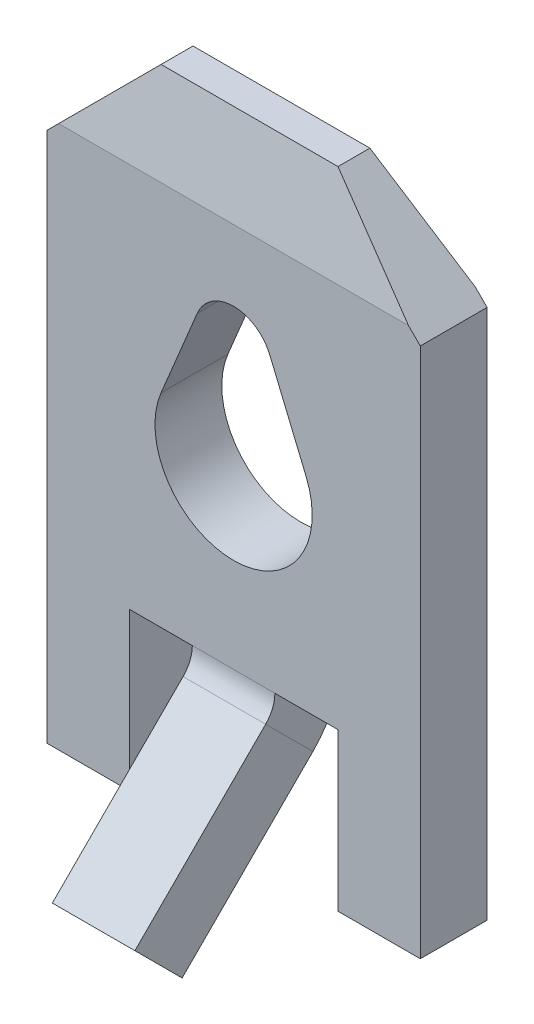
ISO-10303-21;
HEADER;
FILE_DESCRIPTION(('STEP AP214'),'2;1');
FILE_NAME('part.step','',(''),(''),'','','');
FILE_SCHEMA(('AUTOMOTIVE_DESIGN { 1 0 10303 214 1 1 1 1 }'));
ENDSEC;
DATA;
#1=APPLICATION_CONTEXT('core data for automotive mechanical design processes');
#2=APPLICATION_PROTOCOL_DEFINITION('international standard','automotive_design',2000,#1);
#3=PRODUCT_CONTEXT('',#1,'mechanical');
#4=PRODUCT('Part','Part','',(#3));
#5=PRODUCT_RELATED_PRODUCT_CATEGORY('part','',(#4));
#6=PRODUCT_DEFINITION_FORMATION('','',#4);
#7=PRODUCT_DEFINITION_CONTEXT('part definition',#1,'design');
#8=PRODUCT_DEFINITION('design','',#6,#7);
#9=PRODUCT_DEFINITION_SHAPE('','',#8);
#10=(LENGTH_UNIT() NAMED_UNIT(*) SI_UNIT(.MILLI.,.METRE.));
#11=(NAMED_UNIT(*) PLANE_ANGLE_UNIT() SI_UNIT($,.RADIAN.));
#12=(NAMED_UNIT(*) SI_UNIT($,.STERADIAN.) SOLID_ANGLE_UNIT());
#13=UNCERTAINTY_MEASURE_WITH_UNIT(LENGTH_MEASURE(1.E-05),#10,'distance_accuracy_value','');
#14=(GEOMETRIC_REPRESENTATION_CONTEXT(3) GLOBAL_UNCERTAINTY_ASSIGNED_CONTEXT((#13)) GLOBAL_UNIT_ASSIGNED_CONTEXT((#10,
#11,#12)) REPRESENTATION_CONTEXT('',''));
#15=CARTESIAN_POINT('',(0.,0.,0.));
#16=DIRECTION('',(0.,0.,1.));
#17=DIRECTION('',(1.,0.,0.));
#18=AXIS2_PLACEMENT_3D('',#15,#16,#17);
#19=CARTESIAN_POINT('',(4.75,0.149999999999999,0.));
#20=DIRECTION('',(0.,0.,1.));
#21=DIRECTION('',(0.,-1.,0.));
#22=AXIS2_PLACEMENT_3D('',#19,#20,#21);
#23=PLANE('',#22);
#24=DIRECTION('',(0.384813689288076,-0.922994271128754,0.));
#25=VECTOR('',#24,1.);
#26=CARTESIAN_POINT('',(2.84243697464802,5.82748992853653,0.));
#27=LINE('',#26,#25);
#28=CARTESIAN_POINT('',(2.84243697464802,5.82748992853653,0.));
#29=VERTEX_POINT('',#28);
#30=CARTESIAN_POINT('',(3.29799427112875,4.73481368928808,0.));
#31=VERTEX_POINT('',#30);
#32=EDGE_CURVE('E272',#29,#31,#27,.T.);
#33=ORIENTED_EDGE('',*,*,#32,.F.);
#34=CARTESIAN_POINT('',(2.375,5.65,0.));
#35=DIRECTION('',(0.,0.,1.));
#36=DIRECTION('',(0.,-1.,0.));
#37=AXIS2_PLACEMENT_3D('',#34,#35,#36);
#38=CIRCLE('',#37,0.5);
#39=CARTESIAN_POINT('',(1.91346153846154,5.84230769230769,0.));
#40=VERTEX_POINT('',#39);
#41=EDGE_CURVE('E275',#40,#29,#38,.F.);
#42=ORIENTED_EDGE('',*,*,#41,.F.);
#43=DIRECTION('',(0.384615384615385,0.923076923076923,0.));
#44=VECTOR('',#43,1.);
#45=CARTESIAN_POINT('',(1.91346153846154,5.84230769230769,0.));
#46=LINE('',#45,#44);
#47=CARTESIAN_POINT('',(1.45192307692308,4.73461538461538,0.));
#48=VERTEX_POINT('',#47);
#49=EDGE_CURVE('E277',#48,#40,#46,.T.);
#50=ORIENTED_EDGE('',*,*,#49,.F.);
#51=CARTESIAN_POINT('',(2.375,4.35,0.));
#52=DIRECTION('',(0.,0.,1.));
#53=DIRECTION('',(0.,-1.,0.));
#54=AXIS2_PLACEMENT_3D('',#51,#52,#53);
#55=CIRCLE('',#54,1.);
#56=EDGE_CURVE('E269',#31,#48,#55,.F.);
#57=ORIENTED_EDGE('',*,*,#56,.F.);
#58=EDGE_LOOP('',(#33,#42,#50,#57));
#59=FACE_BOUND('',#58,.T.);
#60=DIRECTION('',(1.,0.,0.));
#61=VECTOR('',#60,1.);
#62=CARTESIAN_POINT('',(2.9,2.15,0.));
#63=LINE('',#62,#61);
#64=CARTESIAN_POINT('',(2.9,2.15,0.));
#65=VERTEX_POINT('',#64);
#66=CARTESIAN_POINT('',(3.7,2.15,0.));
#67=VERTEX_POINT('',#66);
#68=EDGE_CURVE('E237',#65,#67,#63,.T.);
#69=ORIENTED_EDGE('',*,*,#68,.F.);
#70=DIRECTION('',(-1.,0.,0.));
#71=VECTOR('',#70,1.);
#72=CARTESIAN_POINT('',(4.75,2.15,0.));
#73=LINE('',#72,#71);
#74=CARTESIAN_POINT('',(1.85000000000001,2.15,0.));
#75=VERTEX_POINT('',#74);
#76=EDGE_CURVE('E50',#65,#75,#73,.T.);
#77=ORIENTED_EDGE('',*,*,#76,.T.);
#78=DIRECTION('',(1.,0.,0.));
#79=VECTOR('',#78,1.);
#80=CARTESIAN_POINT('',(1.85,2.15,0.));
#81=LINE('',#80,#79);
#82=CARTESIAN_POINT('',(1.05,2.15,0.));
#83=VERTEX_POINT('',#82);
#84=EDGE_CURVE('E248',#83,#75,#81,.T.);
#85=ORIENTED_EDGE('',*,*,#84,.F.);
#86=DIRECTION('',(0.,1.,0.));
#87=VECTOR('',#86,1.);
#88=CARTESIAN_POINT('',(1.05,2.15,0.));
#89=LINE('',#88,#87);
#90=CARTESIAN_POINT('',(1.05,0.149999999999999,0.));
#91=VERTEX_POINT('',#90);
#92=EDGE_CURVE('E246',#91,#83,#89,.T.);
#93=ORIENTED_EDGE('',*,*,#92,.F.);
#94=DIRECTION('',(-1.,0.,0.));
#95=VECTOR('',#94,1.);
#96=CARTESIAN_POINT('',(4.75,0.149999999999999,0.));
#97=LINE('',#96,#95);
#98=CARTESIAN_POINT('',(0.,0.149999999999999,0.));
#99=VERTEX_POINT('',#98);
#100=EDGE_CURVE('E346',#91,#99,#97,.T.);
#101=ORIENTED_EDGE('',*,*,#100,.T.);
#102=DIRECTION('',(0.,1.,0.));
#103=VECTOR('',#102,1.);
#104=CARTESIAN_POINT('',(0.,0.149999999999999,0.));
#105=LINE('',#104,#103);
#106=CARTESIAN_POINT('',(0.,6.9,0.));
#107=VERTEX_POINT('',#106);
#108=EDGE_CURVE('E331',#99,#107,#105,.T.);
#109=ORIENTED_EDGE('',*,*,#108,.T.);
#110=DIRECTION('',(-0.707106781186548,-0.707106781186548,0.));
#111=VECTOR('',#110,1.);
#112=CARTESIAN_POINT('',(0.,6.9,0.));
#113=LINE('',#112,#111);
#114=CARTESIAN_POINT('',(0.15,7.05,0.));
#115=VERTEX_POINT('',#114);
#116=EDGE_CURVE('E305',#115,#107,#113,.T.);
#117=ORIENTED_EDGE('',*,*,#116,.F.);
#118=DIRECTION('',(-1.,0.,0.));
#119=VECTOR('',#118,1.);
#120=CARTESIAN_POINT('',(4.75,7.05,0.));
#121=LINE('',#120,#119);
#122=CARTESIAN_POINT('',(4.6,7.05,0.));
#123=VERTEX_POINT('',#122);
#124=EDGE_CURVE('E336',#123,#115,#121,.T.);
#125=ORIENTED_EDGE('',*,*,#124,.F.);
#126=DIRECTION('',(-0.707106781186548,0.707106781186548,0.));
#127=VECTOR('',#126,1.);
#128=CARTESIAN_POINT('',(3.5,8.15,0.));
#129=LINE('',#128,#127);
#130=CARTESIAN_POINT('',(4.75,6.9,0.));
#131=VERTEX_POINT('',#130);
#132=EDGE_CURVE('E301',#131,#123,#129,.T.);
#133=ORIENTED_EDGE('',*,*,#132,.F.);
#134=DIRECTION('',(0.,1.,0.));
#135=VECTOR('',#134,1.);
#136=CARTESIAN_POINT('',(4.75,0.149999999999999,0.));
#137=LINE('',#136,#135);
#138=CARTESIAN_POINT('',(4.75,0.149999999999999,0.));
#139=VERTEX_POINT('',#138);
#140=EDGE_CURVE('E333',#139,#131,#137,.T.);
#141=ORIENTED_EDGE('',*,*,#140,.F.);
#142=CARTESIAN_POINT('',(3.7,0.149999999999999,0.));
#143=VERTEX_POINT('',#142);
#144=EDGE_CURVE('E347',#139,#143,#97,.T.);
#145=ORIENTED_EDGE('',*,*,#144,.T.);
#146=DIRECTION('',(0.,-1.,0.));
#147=VECTOR('',#146,1.);
#148=CARTESIAN_POINT('',(3.7,2.15,0.));
#149=LINE('',#148,#147);
#150=EDGE_CURVE('E261',#67,#143,#149,.T.);
#151=ORIENTED_EDGE('',*,*,#150,.F.);
#152=EDGE_LOOP('',(#69,#77,#85,#93,#101,#109,#117,#125,#133,#141,#145,#151));
#153=FACE_BOUND('',#152,.T.);
#154=ADVANCED_FACE('F43',(#59,#153),#23,.F.);
#155=CARTESIAN_POINT('',(4.75,7.05,0.85));
#156=DIRECTION('',(0.,0.,-1.));
#157=DIRECTION('',(0.,1.,0.));
#158=AXIS2_PLACEMENT_3D('',#155,#156,#157);
#159=PLANE('',#158);
#160=DIRECTION('',(-0.384615384615385,-0.923076923076923,0.));
#161=VECTOR('',#160,1.);
#162=CARTESIAN_POINT('',(1.91346153846154,5.84230769230769,0.849999999999999));
#163=LINE('',#162,#161);
#164=CARTESIAN_POINT('',(1.91346153846154,5.84230769230769,0.85));
#165=VERTEX_POINT('',#164);
#166=CARTESIAN_POINT('',(1.45192307692308,4.73461538461538,0.849999999999999));
#167=VERTEX_POINT('',#166);
#168=EDGE_CURVE('E279',#165,#167,#163,.T.);
#169=ORIENTED_EDGE('',*,*,#168,.F.);
#170=CARTESIAN_POINT('',(2.375,5.65,0.849999999999999));
#171=DIRECTION('',(0.,0.,1.));
#172=DIRECTION('',(1.,0.,0.));
#173=AXIS2_PLACEMENT_3D('',#170,#171,#172);
#174=CIRCLE('',#173,0.5);
#175=CARTESIAN_POINT('',(2.84243697464802,5.82748992853653,0.849999999999999));
#176=VERTEX_POINT('',#175);
#177=EDGE_CURVE('E255',#176,#165,#174,.T.);
#178=ORIENTED_EDGE('',*,*,#177,.F.);
#179=DIRECTION('',(-0.384813689288076,0.922994271128754,0.));
#180=VECTOR('',#179,1.);
#181=CARTESIAN_POINT('',(2.84243697464802,5.82748992853653,0.849999999999999));
#182=LINE('',#181,#180);
#183=CARTESIAN_POINT('',(3.29799427112875,4.73481368928808,0.849999999999999));
#184=VERTEX_POINT('',#183);
#185=EDGE_CURVE('E285',#184,#176,#182,.T.);
#186=ORIENTED_EDGE('',*,*,#185,.F.);
#187=CARTESIAN_POINT('',(2.375,4.35,0.849999999999999));
#188=DIRECTION('',(0.,0.,1.));
#189=DIRECTION('',(1.,0.,0.));
#190=AXIS2_PLACEMENT_3D('',#187,#188,#189);
#191=CIRCLE('',#190,1.);
#192=EDGE_CURVE('E282',#167,#184,#191,.T.);
#193=ORIENTED_EDGE('',*,*,#192,.F.);
#194=EDGE_LOOP('',(#169,#178,#186,#193));
#195=FACE_BOUND('',#194,.T.);
#196=DIRECTION('',(-1.,0.,0.));
#197=VECTOR('',#196,1.);
#198=CARTESIAN_POINT('',(1.85,2.15,0.85));
#199=LINE('',#198,#197);
#200=CARTESIAN_POINT('',(1.85000000000001,2.15,0.849999999999999));
#201=VERTEX_POINT('',#200);
#202=CARTESIAN_POINT('',(1.05,2.15,0.85));
#203=VERTEX_POINT('',#202);
#204=EDGE_CURVE('E242',#201,#203,#199,.T.);
#205=ORIENTED_EDGE('',*,*,#204,.F.);
#206=DIRECTION('',(1.,0.,0.));
#207=VECTOR('',#206,1.);
#208=CARTESIAN_POINT('',(4.75,2.15,0.849999999999999));
#209=LINE('',#208,#207);
#210=CARTESIAN_POINT('',(2.9,2.15,0.849999999999999));
#211=VERTEX_POINT('',#210);
#212=EDGE_CURVE('E363',#201,#211,#209,.T.);
#213=ORIENTED_EDGE('',*,*,#212,.T.);
#214=DIRECTION('',(-1.,0.,0.));
#215=VECTOR('',#214,1.);
#216=CARTESIAN_POINT('',(2.9,2.15,0.85));
#217=LINE('',#216,#215);
#218=CARTESIAN_POINT('',(3.7,2.15,0.85));
#219=VERTEX_POINT('',#218);
#220=EDGE_CURVE('E249',#219,#211,#217,.T.);
#221=ORIENTED_EDGE('',*,*,#220,.F.);
#222=DIRECTION('',(0.,1.,0.));
#223=VECTOR('',#222,1.);
#224=CARTESIAN_POINT('',(3.7,2.15,0.85));
#225=LINE('',#224,#223);
#226=CARTESIAN_POINT('',(3.7,0.149999999999999,0.849999999999999));
#227=VERTEX_POINT('',#226);
#228=EDGE_CURVE('E256',#227,#219,#225,.T.);
#229=ORIENTED_EDGE('',*,*,#228,.F.);
#230=DIRECTION('',(-1.,0.,0.));
#231=VECTOR('',#230,1.);
#232=CARTESIAN_POINT('',(4.75,0.149999999999999,0.849999999999999));
#233=LINE('',#232,#231);
#234=CARTESIAN_POINT('',(4.75,0.149999999999999,0.849999999999999));
#235=VERTEX_POINT('',#234);
#236=EDGE_CURVE('E351',#235,#227,#233,.T.);
#237=ORIENTED_EDGE('',*,*,#236,.F.);
#238=DIRECTION('',(0.,-1.,0.));
#239=VECTOR('',#238,1.);
#240=CARTESIAN_POINT('',(4.75,7.05,0.85));
#241=LINE('',#240,#239);
#242=CARTESIAN_POINT('',(4.75,6.9,0.85));
#243=VERTEX_POINT('',#242);
#244=EDGE_CURVE('E328',#243,#235,#241,.T.);
#245=ORIENTED_EDGE('',*,*,#244,.F.);
#246=DIRECTION('',(0.707106781186548,-0.707106781186548,0.));
#247=VECTOR('',#246,1.);
#248=CARTESIAN_POINT('',(3.5,8.15,0.849999999999999));
#249=LINE('',#248,#247);
#250=CARTESIAN_POINT('',(4.6,7.05,0.849999999999999));
#251=VERTEX_POINT('',#250);
#252=EDGE_CURVE('E297',#251,#243,#249,.T.);
#253=ORIENTED_EDGE('',*,*,#252,.F.);
#254=DIRECTION('',(-1.,0.,0.));
#255=VECTOR('',#254,1.);
#256=CARTESIAN_POINT('',(4.75,7.05,0.85));
#257=LINE('',#256,#255);
#258=CARTESIAN_POINT('',(0.15,7.05,0.849999999999999));
#259=VERTEX_POINT('',#258);
#260=EDGE_CURVE('E354',#251,#259,#257,.T.);
#261=ORIENTED_EDGE('',*,*,#260,.T.);
#262=DIRECTION('',(0.707106781186547,0.707106781186548,0.));
#263=VECTOR('',#262,1.);
#264=CARTESIAN_POINT('',(0.,6.9,0.849999999999999));
#265=LINE('',#264,#263);
#266=CARTESIAN_POINT('',(0.,6.9,0.849999999999999));
#267=VERTEX_POINT('',#266);
#268=EDGE_CURVE('E298',#267,#259,#265,.T.);
#269=ORIENTED_EDGE('',*,*,#268,.F.);
#270=DIRECTION('',(0.,-1.,0.));
#271=VECTOR('',#270,1.);
#272=CARTESIAN_POINT('',(0.,7.05,0.85));
#273=LINE('',#272,#271);
#274=CARTESIAN_POINT('',(0.,0.149999999999999,0.849999999999999));
#275=VERTEX_POINT('',#274);
#276=EDGE_CURVE('E327',#267,#275,#273,.T.);
#277=ORIENTED_EDGE('',*,*,#276,.T.);
#278=CARTESIAN_POINT('',(1.05,0.149999999999999,0.849999999999999));
#279=VERTEX_POINT('',#278);
#280=EDGE_CURVE('E350',#279,#275,#233,.T.);
#281=ORIENTED_EDGE('',*,*,#280,.F.);
#282=DIRECTION('',(0.,-1.,0.));
#283=VECTOR('',#282,1.);
#284=CARTESIAN_POINT('',(1.05,2.15,0.85));
#285=LINE('',#284,#283);
#286=EDGE_CURVE('E244',#203,#279,#285,.T.);
#287=ORIENTED_EDGE('',*,*,#286,.F.);
#288=EDGE_LOOP('',(#205,#213,#221,#229,#237,#245,#253,#261,#269,#277,#281,#287));
#289=FACE_BOUND('',#288,.T.);
#290=ADVANCED_FACE('F383',(#195,#289),#159,.F.);
#291=CARTESIAN_POINT('',(4.75,0.149999999999999,0.));
#292=DIRECTION('',(0.,1.,0.));
#293=DIRECTION('',(0.,0.,1.));
#294=AXIS2_PLACEMENT_3D('',#291,#292,#293);
#295=PLANE('',#294);
#296=ORIENTED_EDGE('',*,*,#100,.F.);
#297=DIRECTION('',(0.,0.,-1.));
#298=VECTOR('',#297,1.);
#299=CARTESIAN_POINT('',(1.05,0.149999999999999,3.0040659228538));
#300=LINE('',#299,#298);
#301=EDGE_CURVE('E64',#279,#91,#300,.T.);
#302=ORIENTED_EDGE('',*,*,#301,.F.);
#303=ORIENTED_EDGE('',*,*,#280,.T.);
#304=DIRECTION('',(0.,0.,-1.));
#305=VECTOR('',#304,1.);
#306=CARTESIAN_POINT('',(0.,0.149999999999999,0.));
#307=LINE('',#306,#305);
#308=EDGE_CURVE('E339',#275,#99,#307,.T.);
#309=ORIENTED_EDGE('',*,*,#308,.T.);
#310=EDGE_LOOP('',(#296,#302,#303,#309));
#311=FACE_BOUND('',#310,.T.);
#312=ADVANCED_FACE('F418',(#311),#295,.F.);
#313=CARTESIAN_POINT('',(4.75,7.05,0.));
#314=DIRECTION('',(0.,-0.214348018272916,0.976757353216485));
#315=DIRECTION('',(0.,-0.976757353216485,-0.214348018272916));
#316=AXIS2_PLACEMENT_3D('',#313,#314,#315);
#317=PLANE('',#316);
#318=ORIENTED_EDGE('',*,*,#124,.T.);
#319=DIRECTION('',(0.698744344369524,0.698744344369524,0.153338457091523));
#320=VECTOR('',#319,1.);
#321=CARTESIAN_POINT('',(2.39592083042662,9.29592083042662,0.492864146468432));
#322=LINE('',#321,#320);
#323=CARTESIAN_POINT('',(1.25,8.15,0.241393442622949));
#324=VERTEX_POINT('',#323);
#325=EDGE_CURVE('E318',#115,#324,#322,.T.);
#326=ORIENTED_EDGE('',*,*,#325,.T.);
#327=DIRECTION('',(-1.,0.,0.));
#328=VECTOR('',#327,1.);
#329=CARTESIAN_POINT('',(4.75,8.15,0.241393442622949));
#330=LINE('',#329,#328);
#331=CARTESIAN_POINT('',(3.5,8.15,0.241393442622949));
#332=VERTEX_POINT('',#331);
#333=EDGE_CURVE('E360',#332,#324,#330,.T.);
#334=ORIENTED_EDGE('',*,*,#333,.F.);
#335=DIRECTION('',(0.698744344369524,-0.698744344369524,-0.153338457091523));
#336=VECTOR('',#335,1.);
#337=CARTESIAN_POINT('',(4.67323654881826,6.97676345118174,-0.0160716569500576));
#338=LINE('',#337,#336);
#339=EDGE_CURVE('E324',#332,#123,#338,.T.);
#340=ORIENTED_EDGE('',*,*,#339,.T.);
#341=EDGE_LOOP('',(#318,#326,#334,#340));
#342=FACE_BOUND('',#341,.T.);
#343=ADVANCED_FACE('F480',(#342),#317,.F.);
#344=CARTESIAN_POINT('',(4.75,8.15,0.241393442622949));
#345=DIRECTION('',(0.,-1.,0.));
#346=DIRECTION('',(0.,0.,-1.));
#347=AXIS2_PLACEMENT_3D('',#344,#345,#346);
#348=PLANE('',#347);
#349=ORIENTED_EDGE('',*,*,#333,.T.);
#350=DIRECTION('',(0.,0.,1.));
#351=VECTOR('',#350,1.);
#352=CARTESIAN_POINT('',(1.25,8.15,-1.76776695296637));
#353=LINE('',#352,#351);
#354=CARTESIAN_POINT('',(1.25,8.15,0.647131147540979));
#355=VERTEX_POINT('',#354);
#356=EDGE_CURVE('E302',#324,#355,#353,.T.);
#357=ORIENTED_EDGE('',*,*,#356,.T.);
#358=DIRECTION('',(-1.,0.,0.));
#359=VECTOR('',#358,1.);
#360=CARTESIAN_POINT('',(4.75,8.15,0.647131147540979));
#361=LINE('',#360,#359);
#362=CARTESIAN_POINT('',(3.5,8.15,0.647131147540979));
#363=VERTEX_POINT('',#362);
#364=EDGE_CURVE('E357',#363,#355,#361,.T.);
#365=ORIENTED_EDGE('',*,*,#364,.F.);
#366=DIRECTION('',(0.,0.,1.));
#367=VECTOR('',#366,1.);
#368=CARTESIAN_POINT('',(3.5,8.15,-1.76776695296637));
#369=LINE('',#368,#367);
#370=EDGE_CURVE('E310',#332,#363,#369,.T.);
#371=ORIENTED_EDGE('',*,*,#370,.F.);
#372=EDGE_LOOP('',(#349,#357,#365,#371));
#373=FACE_BOUND('',#372,.T.);
#374=ADVANCED_FACE('F476',(#373),#348,.F.);
#375=CARTESIAN_POINT('',(4.75,8.15,0.647131147540979));
#376=DIRECTION('',(0.,-0.181367589437408,-0.983415373838371));
#377=DIRECTION('',(0.,0.983415373838371,-0.181367589437408));
#378=AXIS2_PLACEMENT_3D('',#375,#376,#377);
#379=PLANE('',#378);
#380=ORIENTED_EDGE('',*,*,#364,.T.);
#381=DIRECTION('',(-0.70116968993079,-0.70116968993079,0.12931408215937));
#382=VECTOR('',#381,1.);
#383=CARTESIAN_POINT('',(2.97073626927174,9.87073626927174,0.329782245421185));
#384=LINE('',#383,#382);
#385=EDGE_CURVE('E308',#355,#259,#384,.T.);
#386=ORIENTED_EDGE('',*,*,#385,.T.);
#387=ORIENTED_EDGE('',*,*,#260,.F.);
#388=DIRECTION('',(-0.70116968993079,0.70116968993079,-0.12931408215937));
#389=VECTOR('',#388,1.);
#390=CARTESIAN_POINT('',(4.11454866759705,7.53545133240295,0.760470041155192));
#391=LINE('',#390,#389);
#392=EDGE_CURVE('E321',#251,#363,#391,.T.);
#393=ORIENTED_EDGE('',*,*,#392,.T.);
#394=EDGE_LOOP('',(#380,#386,#387,#393));
#395=FACE_BOUND('',#394,.T.);
#396=ADVANCED_FACE('F472',(#395),#379,.F.);
#397=ORIENTED_EDGE('',*,*,#236,.T.);
#398=DIRECTION('',(0.,0.,-1.));
#399=VECTOR('',#398,1.);
#400=CARTESIAN_POINT('',(3.7,0.149999999999999,3.0040659228538));
#401=LINE('',#400,#399);
#402=EDGE_CURVE('E258',#227,#143,#401,.T.);
#403=ORIENTED_EDGE('',*,*,#402,.T.);
#404=ORIENTED_EDGE('',*,*,#144,.F.);
#405=DIRECTION('',(0.,0.,-1.));
#406=VECTOR('',#405,1.);
#407=CARTESIAN_POINT('',(4.75,0.149999999999999,0.));
#408=LINE('',#407,#406);
#409=EDGE_CURVE('E330',#235,#139,#408,.T.);
#410=ORIENTED_EDGE('',*,*,#409,.F.);
#411=EDGE_LOOP('',(#397,#403,#404,#410));
#412=FACE_BOUND('',#411,.T.);
#413=ADVANCED_FACE('F465',(#412),#295,.F.);
#414=CARTESIAN_POINT('',(4.75,0.,0.));
#415=DIRECTION('',(1.,0.,0.));
#416=DIRECTION('',(0.,0.,-1.));
#417=AXIS2_PLACEMENT_3D('',#414,#415,#416);
#418=PLANE('',#417);
#419=DIRECTION('',(0.,0.,1.));
#420=VECTOR('',#419,1.);
#421=CARTESIAN_POINT('',(4.75,6.9,-1.76776695296637));
#422=LINE('',#421,#420);
#423=EDGE_CURVE('E311',#131,#243,#422,.T.);
#424=ORIENTED_EDGE('',*,*,#423,.T.);
#425=ORIENTED_EDGE('',*,*,#244,.T.);
#426=ORIENTED_EDGE('',*,*,#409,.T.);
#427=ORIENTED_EDGE('',*,*,#140,.T.);
#428=EDGE_LOOP('',(#424,#425,#426,#427));
#429=FACE_BOUND('',#428,.T.);
#430=ADVANCED_FACE('F462',(#429),#418,.T.);
#431=CARTESIAN_POINT('',(0.,0.,0.));
#432=DIRECTION('',(1.,0.,0.));
#433=DIRECTION('',(0.,0.,-1.));
#434=AXIS2_PLACEMENT_3D('',#431,#432,#433);
#435=PLANE('',#434);
#436=ORIENTED_EDGE('',*,*,#276,.F.);
#437=DIRECTION('',(0.,0.,1.));
#438=VECTOR('',#437,1.);
#439=CARTESIAN_POINT('',(0.,6.9,-1.76776695296637));
#440=LINE('',#439,#438);
#441=EDGE_CURVE('E300',#107,#267,#440,.T.);
#442=ORIENTED_EDGE('',*,*,#441,.F.);
#443=ORIENTED_EDGE('',*,*,#108,.F.);
#444=ORIENTED_EDGE('',*,*,#308,.F.);
#445=EDGE_LOOP('',(#436,#442,#443,#444));
#446=FACE_BOUND('',#445,.T.);
#447=ADVANCED_FACE('F457',(#446),#435,.F.);
#448=CARTESIAN_POINT('',(0.,6.9,-1.76776695296637));
#449=DIRECTION('',(0.707106781186548,-0.707106781186548,0.));
#450=DIRECTION('',(0.707106781186548,0.707106781186548,0.));
#451=AXIS2_PLACEMENT_3D('',#448,#449,#450);
#452=PLANE('',#451);
#453=ORIENTED_EDGE('',*,*,#116,.T.);
#454=ORIENTED_EDGE('',*,*,#441,.T.);
#455=ORIENTED_EDGE('',*,*,#268,.T.);
#456=ORIENTED_EDGE('',*,*,#385,.F.);
#457=ORIENTED_EDGE('',*,*,#356,.F.);
#458=ORIENTED_EDGE('',*,*,#325,.F.);
#459=EDGE_LOOP('',(#453,#454,#455,#456,#457,#458));
#460=FACE_BOUND('',#459,.T.);
#461=ADVANCED_FACE('F454',(#460),#452,.F.);
#462=CARTESIAN_POINT('',(3.5,8.15,-1.76776695296637));
#463=DIRECTION('',(-0.707106781186547,-0.707106781186547,0.));
#464=DIRECTION('',(0.707106781186548,-0.707106781186548,0.));
#465=AXIS2_PLACEMENT_3D('',#462,#463,#464);
#466=PLANE('',#465);
#467=ORIENTED_EDGE('',*,*,#370,.T.);
#468=ORIENTED_EDGE('',*,*,#392,.F.);
#469=ORIENTED_EDGE('',*,*,#252,.T.);
#470=ORIENTED_EDGE('',*,*,#423,.F.);
#471=ORIENTED_EDGE('',*,*,#132,.T.);
#472=ORIENTED_EDGE('',*,*,#339,.F.);
#473=EDGE_LOOP('',(#467,#468,#469,#470,#471,#472));
#474=FACE_BOUND('',#473,.T.);
#475=ADVANCED_FACE('F453',(#474),#466,.F.);
#476=CARTESIAN_POINT('',(2.375,5.65,-3.44093010681705));
#477=DIRECTION('',(0.,0.,1.));
#478=DIRECTION('',(1.,0.,0.));
#479=AXIS2_PLACEMENT_3D('',#476,#477,#478);
#480=CYLINDRICAL_SURFACE('',#479,0.5);
#481=ORIENTED_EDGE('',*,*,#41,.T.);
#482=DIRECTION('',(0.,0.,1.));
#483=VECTOR('',#482,1.);
#484=CARTESIAN_POINT('',(2.84243697464802,5.82748992853653,-3.44093010681705));
#485=LINE('',#484,#483);
#486=EDGE_CURVE('E273',#29,#176,#485,.T.);
#487=ORIENTED_EDGE('',*,*,#486,.T.);
#488=ORIENTED_EDGE('',*,*,#177,.T.);
#489=DIRECTION('',(0.,0.,1.));
#490=VECTOR('',#489,1.);
#491=CARTESIAN_POINT('',(1.91346153846154,5.84230769230769,-3.44093010681705));
#492=LINE('',#491,#490);
#493=EDGE_CURVE('E288',#40,#165,#492,.T.);
#494=ORIENTED_EDGE('',*,*,#493,.F.);
#495=EDGE_LOOP('',(#481,#487,#488,#494));
#496=FACE_BOUND('',#495,.T.);
#497=ADVANCED_FACE('F436',(#496),#480,.F.);
#498=CARTESIAN_POINT('',(2.84243697464802,5.82748992853653,-3.44093010681705));
#499=DIRECTION('',(0.922994271128754,0.384813689288076,0.));
#500=DIRECTION('',(-0.384813689288076,0.922994271128754,0.));
#501=AXIS2_PLACEMENT_3D('',#498,#499,#500);
#502=PLANE('',#501);
#503=ORIENTED_EDGE('',*,*,#32,.T.);
#504=DIRECTION('',(0.,0.,1.));
#505=VECTOR('',#504,1.);
#506=CARTESIAN_POINT('',(3.29799427112875,4.73481368928808,-3.44093010681705));
#507=LINE('',#506,#505);
#508=EDGE_CURVE('E290',#31,#184,#507,.T.);
#509=ORIENTED_EDGE('',*,*,#508,.T.);
#510=ORIENTED_EDGE('',*,*,#185,.T.);
#511=ORIENTED_EDGE('',*,*,#486,.F.);
#512=EDGE_LOOP('',(#503,#509,#510,#511));
#513=FACE_BOUND('',#512,.T.);
#514=ADVANCED_FACE('F427',(#513),#502,.F.);
#515=CARTESIAN_POINT('',(2.375,4.35,-3.44093010681705));
#516=DIRECTION('',(0.,0.,1.));
#517=DIRECTION('',(1.,0.,0.));
#518=AXIS2_PLACEMENT_3D('',#515,#516,#517);
#519=CYLINDRICAL_SURFACE('',#518,1.);
#520=ORIENTED_EDGE('',*,*,#56,.T.);
#521=DIRECTION('',(0.,0.,1.));
#522=VECTOR('',#521,1.);
#523=CARTESIAN_POINT('',(1.45192307692308,4.73461538461538,-3.44093010681705));
#524=LINE('',#523,#522);
#525=EDGE_CURVE('E292',#48,#167,#524,.T.);
#526=ORIENTED_EDGE('',*,*,#525,.T.);
#527=ORIENTED_EDGE('',*,*,#192,.T.);
#528=ORIENTED_EDGE('',*,*,#508,.F.);
#529=EDGE_LOOP('',(#520,#526,#527,#528));
#530=FACE_BOUND('',#529,.T.);
#531=ADVANCED_FACE('F429',(#530),#519,.F.);
#532=CARTESIAN_POINT('',(1.91346153846154,5.84230769230769,-3.44093010681705));
#533=DIRECTION('',(-0.923076923076923,0.384615384615385,0.));
#534=DIRECTION('',(-0.384615384615385,-0.923076923076923,0.));
#535=AXIS2_PLACEMENT_3D('',#532,#533,#534);
#536=PLANE('',#535);
#537=ORIENTED_EDGE('',*,*,#49,.T.);
#538=ORIENTED_EDGE('',*,*,#493,.T.);
#539=ORIENTED_EDGE('',*,*,#168,.T.);
#540=ORIENTED_EDGE('',*,*,#525,.F.);
#541=EDGE_LOOP('',(#537,#538,#539,#540));
#542=FACE_BOUND('',#541,.T.);
#543=ADVANCED_FACE('F438',(#542),#536,.F.);
#544=CARTESIAN_POINT('',(3.7,2.15,3.0040659228538));
#545=DIRECTION('',(1.,0.,0.));
#546=DIRECTION('',(0.,1.,0.));
#547=AXIS2_PLACEMENT_3D('',#544,#545,#546);
#548=PLANE('',#547);
#549=ORIENTED_EDGE('',*,*,#228,.T.);
#550=DIRECTION('',(0.,0.,-1.));
#551=VECTOR('',#550,1.);
#552=CARTESIAN_POINT('',(3.7,2.15,3.0040659228538));
#553=LINE('',#552,#551);
#554=EDGE_CURVE('E263',#219,#67,#553,.T.);
#555=ORIENTED_EDGE('',*,*,#554,.T.);
#556=ORIENTED_EDGE('',*,*,#150,.T.);
#557=ORIENTED_EDGE('',*,*,#402,.F.);
#558=EDGE_LOOP('',(#549,#555,#556,#557));
#559=FACE_BOUND('',#558,.T.);
#560=ADVANCED_FACE('F440',(#559),#548,.F.);
#561=CARTESIAN_POINT('',(2.9,2.15,3.0040659228538));
#562=DIRECTION('',(0.,1.,0.));
#563=DIRECTION('',(-1.,0.,0.));
#564=AXIS2_PLACEMENT_3D('',#561,#562,#563);
#565=PLANE('',#564);
#566=ORIENTED_EDGE('',*,*,#220,.T.);
#567=DIRECTION('',(0.,0.,-1.));
#568=VECTOR('',#567,1.);
#569=CARTESIAN_POINT('',(2.9,2.15,3.0040659228538));
#570=LINE('',#569,#568);
#571=EDGE_CURVE('E12',#211,#65,#570,.T.);
#572=ORIENTED_EDGE('',*,*,#571,.T.);
#573=ORIENTED_EDGE('',*,*,#68,.T.);
#574=ORIENTED_EDGE('',*,*,#554,.F.);
#575=EDGE_LOOP('',(#566,#572,#573,#574));
#576=FACE_BOUND('',#575,.T.);
#577=ADVANCED_FACE('F373',(#576),#565,.F.);
#578=CARTESIAN_POINT('',(1.85,2.15,3.0040659228538));
#579=DIRECTION('',(0.,1.,0.));
#580=DIRECTION('',(0.,0.,1.));
#581=AXIS2_PLACEMENT_3D('',#578,#579,#580);
#582=PLANE('',#581);
#583=ORIENTED_EDGE('',*,*,#204,.T.);
#584=DIRECTION('',(0.,0.,-1.));
#585=VECTOR('',#584,1.);
#586=CARTESIAN_POINT('',(1.05,2.15,3.0040659228538));
#587=LINE('',#586,#585);
#588=EDGE_CURVE('E245',#203,#83,#587,.T.);
#589=ORIENTED_EDGE('',*,*,#588,.T.);
#590=ORIENTED_EDGE('',*,*,#84,.T.);
#591=DIRECTION('',(0.,0.,-1.));
#592=VECTOR('',#591,1.);
#593=CARTESIAN_POINT('',(1.85,2.15,3.0040659228538));
#594=LINE('',#593,#592);
#595=EDGE_CURVE('E366',#201,#75,#594,.T.);
#596=ORIENTED_EDGE('',*,*,#595,.F.);
#597=EDGE_LOOP('',(#583,#589,#590,#596));
#598=FACE_BOUND('',#597,.T.);
#599=ADVANCED_FACE('F390',(#598),#582,.F.);
#600=CARTESIAN_POINT('',(1.05,2.15,3.0040659228538));
#601=DIRECTION('',(-1.,0.,0.));
#602=DIRECTION('',(0.,-1.,0.));
#603=AXIS2_PLACEMENT_3D('',#600,#601,#602);
#604=PLANE('',#603);
#605=ORIENTED_EDGE('',*,*,#286,.T.);
#606=ORIENTED_EDGE('',*,*,#301,.T.);
#607=ORIENTED_EDGE('',*,*,#92,.T.);
#608=ORIENTED_EDGE('',*,*,#588,.F.);
#609=EDGE_LOOP('',(#605,#606,#607,#608));
#610=FACE_BOUND('',#609,.T.);
#611=ADVANCED_FACE('F507',(#610),#604,.F.);
#612=CARTESIAN_POINT('',(1.85,2.15,1.25));
#613=DIRECTION('',(1.,0.,0.));
#614=DIRECTION('',(0.,1.,0.));
#615=AXIS2_PLACEMENT_3D('',#612,#613,#614);
#616=PLANE('',#615);
#617=ORIENTED_EDGE('',*,*,#595,.T.);
#618=CARTESIAN_POINT('',(1.85000000000001,2.15,1.25));
#619=DIRECTION('',(1.,0.,0.));
#620=DIRECTION('',(0.,1.,0.));
#621=AXIS2_PLACEMENT_3D('',#618,#619,#620);
#622=CIRCLE('',#621,1.25);
#623=CARTESIAN_POINT('',(1.85,1.26611652351682,0.366116523516817));
#624=VERTEX_POINT('',#623);
#625=EDGE_CURVE('E239',#75,#624,#622,.F.);
#626=ORIENTED_EDGE('',*,*,#625,.T.);
#627=DIRECTION('',(0.,0.707106781186544,0.707106781186551));
#628=VECTOR('',#627,1.);
#629=CARTESIAN_POINT('',(1.85,3.39031190869815,2.49031190869817));
#630=LINE('',#629,#628);
#631=CARTESIAN_POINT('',(1.85,1.86715728752538,0.967157287525381));
#632=VERTEX_POINT('',#631);
#633=EDGE_CURVE('E218',#624,#632,#630,.T.);
#634=ORIENTED_EDGE('',*,*,#633,.T.);
#635=CARTESIAN_POINT('',(1.85,2.15,1.25));
#636=DIRECTION('',(-1.,0.,0.));
#637=DIRECTION('',(0.,1.,0.));
#638=AXIS2_PLACEMENT_3D('',#635,#636,#637);
#639=CIRCLE('',#638,0.4);
#640=EDGE_CURVE('E230',#201,#632,#639,.T.);
#641=ORIENTED_EDGE('',*,*,#640,.F.);
#642=EDGE_LOOP('',(#617,#626,#634,#641));
#643=FACE_BOUND('',#642,.T.);
#644=ADVANCED_FACE('F392',(#643),#616,.F.);
#645=CARTESIAN_POINT('',(2.9,2.15,1.25));
#646=DIRECTION('',(-1.,0.,0.));
#647=DIRECTION('',(0.,0.,1.));
#648=AXIS2_PLACEMENT_3D('',#645,#646,#647);
#649=PLANE('',#648);
#650=DIRECTION('',(0.,-0.707106781186544,-0.707106781186551));
#651=VECTOR('',#650,1.);
#652=CARTESIAN_POINT('',(2.9,3.39031190869815,2.49031190869817));
#653=LINE('',#652,#651);
#654=CARTESIAN_POINT('',(2.9,1.86715728752538,0.96715728752538));
#655=VERTEX_POINT('',#654);
#656=CARTESIAN_POINT('',(2.9,1.26611652351682,0.366116523516817));
#657=VERTEX_POINT('',#656);
#658=EDGE_CURVE('E199',#655,#657,#653,.T.);
#659=ORIENTED_EDGE('',*,*,#658,.T.);
#660=CARTESIAN_POINT('',(2.9,2.15,1.25));
#661=DIRECTION('',(1.,0.,0.));
#662=DIRECTION('',(0.,1.,0.));
#663=AXIS2_PLACEMENT_3D('',#660,#661,#662);
#664=CIRCLE('',#663,1.25);
#665=EDGE_CURVE('E234',#657,#65,#664,.T.);
#666=ORIENTED_EDGE('',*,*,#665,.T.);
#667=ORIENTED_EDGE('',*,*,#571,.F.);
#668=CARTESIAN_POINT('',(2.9,2.15,1.25));
#669=DIRECTION('',(1.,0.,0.));
#670=DIRECTION('',(0.,0.,1.));
#671=AXIS2_PLACEMENT_3D('',#668,#669,#670);
#672=CIRCLE('',#671,0.4);
#673=EDGE_CURVE('E233',#655,#211,#672,.T.);
#674=ORIENTED_EDGE('',*,*,#673,.F.);
#675=EDGE_LOOP('',(#659,#666,#667,#674));
#676=FACE_BOUND('',#675,.T.);
#677=ADVANCED_FACE('F377',(#676),#649,.F.);
#678=CARTESIAN_POINT('',(0.876719746353102,2.15,1.25));
#679=DIRECTION('',(1.,0.,0.));
#680=DIRECTION('',(0.,1.,0.));
#681=AXIS2_PLACEMENT_3D('',#678,#679,#680);
#682=CYLINDRICAL_SURFACE('',#681,0.4);
#683=ORIENTED_EDGE('',*,*,#673,.T.);
#684=ORIENTED_EDGE('',*,*,#212,.F.);
#685=ORIENTED_EDGE('',*,*,#640,.T.);
#686=DIRECTION('',(1.,0.,0.));
#687=VECTOR('',#686,1.);
#688=CARTESIAN_POINT('',(4.75,1.86715728752538,0.967157287525383));
#689=LINE('',#688,#687);
#690=EDGE_CURVE('E228',#632,#655,#689,.T.);
#691=ORIENTED_EDGE('',*,*,#690,.T.);
#692=EDGE_LOOP('',(#683,#684,#685,#691));
#693=FACE_BOUND('',#692,.T.);
#694=ADVANCED_FACE('F380',(#693),#682,.F.);
#695=CARTESIAN_POINT('',(0.876719746353102,2.15,1.25));
#696=DIRECTION('',(1.,0.,0.));
#697=DIRECTION('',(0.,1.,0.));
#698=AXIS2_PLACEMENT_3D('',#695,#696,#697);
#699=CYLINDRICAL_SURFACE('',#698,1.25);
#700=ORIENTED_EDGE('',*,*,#665,.F.);
#701=DIRECTION('',(-1.,0.,0.));
#702=VECTOR('',#701,1.);
#703=CARTESIAN_POINT('',(4.75,1.26611652351682,0.366116523516814));
#704=LINE('',#703,#702);
#705=EDGE_CURVE('E221',#657,#624,#704,.T.);
#706=ORIENTED_EDGE('',*,*,#705,.T.);
#707=ORIENTED_EDGE('',*,*,#625,.F.);
#708=ORIENTED_EDGE('',*,*,#76,.F.);
#709=EDGE_LOOP('',(#700,#706,#707,#708));
#710=FACE_BOUND('',#709,.T.);
#711=ADVANCED_FACE('F393',(#710),#699,.T.);
#712=CARTESIAN_POINT('',(0.,-0.397031517045243,2.02926456407888));
#713=DIRECTION('',(0.,-0.707106781186546,0.707106781186549));
#714=DIRECTION('',(0.,-0.707106781186549,-0.707106781186546));
#715=AXIS2_PLACEMENT_3D('',#712,#713,#714);
#716=PLANE('',#715);
#717=DIRECTION('',(0.,0.707106781186549,0.707106781186546));
#718=VECTOR('',#717,1.);
#719=CARTESIAN_POINT('',(2.9,-0.397031517045244,2.02926456407888));
#720=LINE('',#719,#718);
#721=CARTESIAN_POINT('',(2.9,-0.397031517045244,2.02926456407888));
#722=VERTEX_POINT('',#721);
#723=CARTESIAN_POINT('',(2.9,0.204009246963322,2.63030532808745));
#724=VERTEX_POINT('',#723);
#725=EDGE_CURVE('E197',#722,#724,#720,.T.);
#726=ORIENTED_EDGE('',*,*,#725,.T.);
#727=DIRECTION('',(-1.,0.,0.));
#728=VECTOR('',#727,1.);
#729=CARTESIAN_POINT('',(2.9,0.204009246963322,2.63030532808745));
#730=LINE('',#729,#728);
#731=CARTESIAN_POINT('',(1.85,0.204009246963323,2.63030532808745));
#732=VERTEX_POINT('',#731);
#733=EDGE_CURVE('E206',#724,#732,#730,.T.);
#734=ORIENTED_EDGE('',*,*,#733,.T.);
#735=DIRECTION('',(0.,-0.707106781186549,-0.707106781186546));
#736=VECTOR('',#735,1.);
#737=CARTESIAN_POINT('',(1.85,0.204009246963323,2.63030532808745));
#738=LINE('',#737,#736);
#739=CARTESIAN_POINT('',(1.85,-0.397031517045243,2.02926456407888));
#740=VERTEX_POINT('',#739);
#741=EDGE_CURVE('E212',#732,#740,#738,.T.);
#742=ORIENTED_EDGE('',*,*,#741,.T.);
#743=DIRECTION('',(1.,0.,0.));
#744=VECTOR('',#743,1.);
#745=CARTESIAN_POINT('',(1.85,-0.397031517045243,2.02926456407888));
#746=LINE('',#745,#744);
#747=EDGE_CURVE('E217',#740,#722,#746,.T.);
#748=ORIENTED_EDGE('',*,*,#747,.T.);
#749=EDGE_LOOP('',(#726,#734,#742,#748));
#750=FACE_BOUND('',#749,.T.);
#751=ADVANCED_FACE('F215',(#750),#716,.T.);
#752=CARTESIAN_POINT('',(4.75,5.79015281833704,-2.95583824328629));
#753=DIRECTION('',(0.,-0.707106781186549,-0.707106781186546));
#754=DIRECTION('',(0.,0.707106781186546,-0.707106781186549));
#755=AXIS2_PLACEMENT_3D('',#752,#753,#754);
#756=PLANE('',#755);
#757=ORIENTED_EDGE('',*,*,#690,.F.);
#758=DIRECTION('',(0.,0.707106781186546,-0.707106781186549));
#759=VECTOR('',#758,1.);
#760=CARTESIAN_POINT('',(1.85,2.32532959052296,0.508984984527799));
#761=LINE('',#760,#759);
#762=EDGE_CURVE('E203',#732,#632,#761,.T.);
#763=ORIENTED_EDGE('',*,*,#762,.F.);
#764=ORIENTED_EDGE('',*,*,#733,.F.);
#765=DIRECTION('',(0.,-0.707106781186546,0.707106781186549));
#766=VECTOR('',#765,1.);
#767=CARTESIAN_POINT('',(2.9,2.32532959052296,0.508984984527799));
#768=LINE('',#767,#766);
#769=EDGE_CURVE('E193',#655,#724,#768,.T.);
#770=ORIENTED_EDGE('',*,*,#769,.F.);
#771=EDGE_LOOP('',(#757,#763,#764,#770));
#772=FACE_BOUND('',#771,.T.);
#773=ADVANCED_FACE('F207',(#772),#756,.F.);
#774=CARTESIAN_POINT('',(1.85,3.84848421169575,2.03213960570058));
#775=DIRECTION('',(1.,0.,0.));
#776=DIRECTION('',(0.,0.707106781186546,-0.707106781186549));
#777=AXIS2_PLACEMENT_3D('',#774,#775,#776);
#778=PLANE('',#777);
#779=ORIENTED_EDGE('',*,*,#633,.F.);
#780=DIRECTION('',(0.,-0.707106781186546,0.707106781186549));
#781=VECTOR('',#780,1.);
#782=CARTESIAN_POINT('',(1.85,1.7242888265144,-0.0920557794807644));
#783=LINE('',#782,#781);
#784=EDGE_CURVE('E397',#624,#740,#783,.T.);
#785=ORIENTED_EDGE('',*,*,#784,.T.);
#786=ORIENTED_EDGE('',*,*,#741,.F.);
#787=ORIENTED_EDGE('',*,*,#762,.T.);
#788=EDGE_LOOP('',(#779,#785,#786,#787));
#789=FACE_BOUND('',#788,.T.);
#790=ADVANCED_FACE('F401',(#789),#778,.F.);
#791=CARTESIAN_POINT('',(4.75,0.310075264141302,1.32215778289233));
#792=DIRECTION('',(0.,0.707106781186549,0.707106781186546));
#793=DIRECTION('',(0.,-0.707106781186546,0.707106781186549));
#794=AXIS2_PLACEMENT_3D('',#791,#792,#793);
#795=PLANE('',#794);
#796=ORIENTED_EDGE('',*,*,#705,.F.);
#797=DIRECTION('',(0.,0.707106781186546,-0.707106781186549));
#798=VECTOR('',#797,1.);
#799=CARTESIAN_POINT('',(2.9,1.7242888265144,-0.0920557794807646));
#800=LINE('',#799,#798);
#801=EDGE_CURVE('E202',#722,#657,#800,.T.);
#802=ORIENTED_EDGE('',*,*,#801,.F.);
#803=ORIENTED_EDGE('',*,*,#747,.F.);
#804=ORIENTED_EDGE('',*,*,#784,.F.);
#805=EDGE_LOOP('',(#796,#802,#803,#804));
#806=FACE_BOUND('',#805,.T.);
#807=ADVANCED_FACE('F396',(#806),#795,.F.);
#808=CARTESIAN_POINT('',(2.9,3.84848421169575,2.03213960570058));
#809=DIRECTION('',(-1.,0.,0.));
#810=DIRECTION('',(0.,-0.707106781186546,0.707106781186549));
#811=AXIS2_PLACEMENT_3D('',#808,#809,#810);
#812=PLANE('',#811);
#813=ORIENTED_EDGE('',*,*,#658,.F.);
#814=ORIENTED_EDGE('',*,*,#769,.T.);
#815=ORIENTED_EDGE('',*,*,#725,.F.);
#816=ORIENTED_EDGE('',*,*,#801,.T.);
#817=EDGE_LOOP('',(#813,#814,#815,#816));
#818=FACE_BOUND('',#817,.T.);
#819=ADVANCED_FACE('F195',(#818),#812,.F.);
#820=CLOSED_SHELL('',(#154,#290,#312,#343,#374,#396,#413,#430,#447,#461,#475,#497,#514,#531,
#543,#560,#577,#599,#611,#644,#677,#694,#711,#751,#773,#790,#807,#819));
#821=MANIFOLD_SOLID_BREP('B2',#820);
#822=ADVANCED_BREP_SHAPE_REPRESENTATION('',(#18,#821),#14);
#823=SHAPE_DEFINITION_REPRESENTATION(#9,#822);
ENDSEC;
END-ISO-10303-21;
